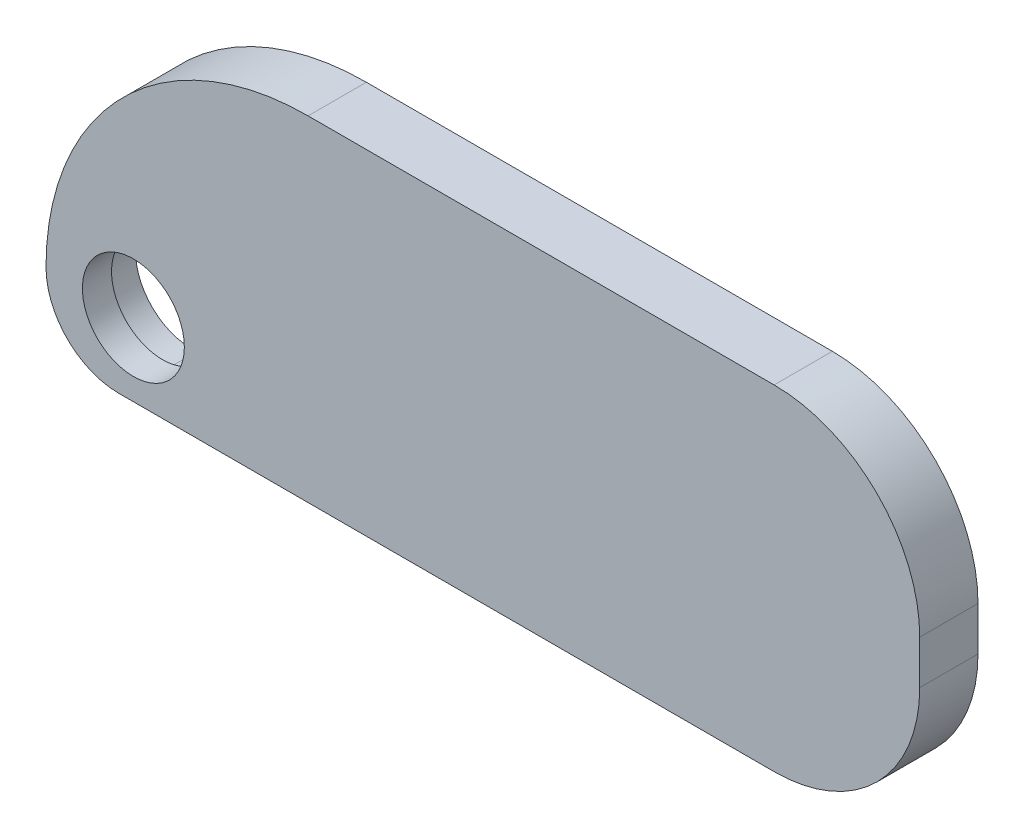
ISO-10303-21;
HEADER;
FILE_DESCRIPTION(('STEP AP214'),'2;1');
FILE_NAME('part.step','',(''),(''),'','','');
FILE_SCHEMA(('AUTOMOTIVE_DESIGN { 1 0 10303 214 1 1 1 1 }'));
ENDSEC;
DATA;
#1=APPLICATION_CONTEXT('core data for automotive mechanical design processes');
#2=APPLICATION_PROTOCOL_DEFINITION('international standard','automotive_design',2000,#1);
#3=PRODUCT_CONTEXT('',#1,'mechanical');
#4=PRODUCT('Part','Part','',(#3));
#5=PRODUCT_RELATED_PRODUCT_CATEGORY('part','',(#4));
#6=PRODUCT_DEFINITION_FORMATION('','',#4);
#7=PRODUCT_DEFINITION_CONTEXT('part definition',#1,'design');
#8=PRODUCT_DEFINITION('design','',#6,#7);
#9=PRODUCT_DEFINITION_SHAPE('','',#8);
#10=(LENGTH_UNIT() NAMED_UNIT(*) SI_UNIT(.MILLI.,.METRE.));
#11=(NAMED_UNIT(*) PLANE_ANGLE_UNIT() SI_UNIT($,.RADIAN.));
#12=(NAMED_UNIT(*) SI_UNIT($,.STERADIAN.) SOLID_ANGLE_UNIT());
#13=UNCERTAINTY_MEASURE_WITH_UNIT(LENGTH_MEASURE(1.E-05),#10,'distance_accuracy_value','');
#14=(GEOMETRIC_REPRESENTATION_CONTEXT(3) GLOBAL_UNCERTAINTY_ASSIGNED_CONTEXT((#13)) GLOBAL_UNIT_ASSIGNED_CONTEXT((#10,
#11,#12)) REPRESENTATION_CONTEXT('',''));
#15=CARTESIAN_POINT('',(0.,0.,0.));
#16=DIRECTION('',(0.,0.,1.));
#17=DIRECTION('',(1.,0.,0.));
#18=AXIS2_PLACEMENT_3D('',#15,#16,#17);
#19=CARTESIAN_POINT('',(0.,18.,-4.));
#20=DIRECTION('',(0.,-1.,0.));
#21=DIRECTION('',(0.,0.,1.));
#22=AXIS2_PLACEMENT_3D('',#19,#20,#21);
#23=PLANE('',#22);
#24=DIRECTION('',(0.,0.,-1.));
#25=VECTOR('',#24,1.);
#26=CARTESIAN_POINT('',(18.,18.,0.));
#27=LINE('',#26,#25);
#28=CARTESIAN_POINT('',(18.,18.,0.));
#29=VERTEX_POINT('',#28);
#30=CARTESIAN_POINT('',(18.,18.,-4.));
#31=VERTEX_POINT('',#30);
#32=EDGE_CURVE('E122',#29,#31,#27,.T.);
#33=ORIENTED_EDGE('',*,*,#32,.F.);
#34=DIRECTION('',(-1.,0.,0.));
#35=VECTOR('',#34,1.);
#36=CARTESIAN_POINT('',(0.,18.,0.));
#37=LINE('',#36,#35);
#38=CARTESIAN_POINT('',(50.,18.,0.));
#39=VERTEX_POINT('',#38);
#40=EDGE_CURVE('E128',#39,#29,#37,.T.);
#41=ORIENTED_EDGE('',*,*,#40,.F.);
#42=DIRECTION('',(0.,0.,1.));
#43=VECTOR('',#42,1.);
#44=CARTESIAN_POINT('',(50.,18.,-4.));
#45=LINE('',#44,#43);
#46=CARTESIAN_POINT('',(50.,18.,-4.));
#47=VERTEX_POINT('',#46);
#48=EDGE_CURVE('E187',#47,#39,#45,.T.);
#49=ORIENTED_EDGE('',*,*,#48,.F.);
#50=DIRECTION('',(-1.,0.,0.));
#51=VECTOR('',#50,1.);
#52=CARTESIAN_POINT('',(0.,18.,-4.));
#53=LINE('',#52,#51);
#54=EDGE_CURVE('E140',#47,#31,#53,.T.);
#55=ORIENTED_EDGE('',*,*,#54,.T.);
#56=EDGE_LOOP('',(#33,#41,#49,#55));
#57=FACE_BOUND('',#56,.T.);
#58=ADVANCED_FACE('F39',(#57),#23,.F.);
#59=CARTESIAN_POINT('',(6.,0.,0.));
#60=DIRECTION('',(0.,0.,-1.));
#61=DIRECTION('',(1.,0.,0.));
#62=AXIS2_PLACEMENT_3D('',#59,#60,#61);
#63=CYLINDRICAL_SURFACE('',#62,3.5);
#64=CARTESIAN_POINT('',(6.,0.,0.));
#65=DIRECTION('',(0.,0.,1.));
#66=DIRECTION('',(1.,0.,0.));
#67=AXIS2_PLACEMENT_3D('',#64,#65,#66);
#68=CIRCLE('',#67,3.5);
#69=CARTESIAN_POINT('',(9.5,0.,0.));
#70=VERTEX_POINT('',#69);
#71=EDGE_CURVE('E177',#70,#70,#68,.T.);
#72=ORIENTED_EDGE('',*,*,#71,.T.);
#73=EDGE_LOOP('',(#72));
#74=FACE_BOUND('',#73,.T.);
#75=CARTESIAN_POINT('',(6.,0.,-2.));
#76=DIRECTION('',(0.,0.,1.));
#77=DIRECTION('',(1.,0.,0.));
#78=AXIS2_PLACEMENT_3D('',#75,#76,#77);
#79=CIRCLE('',#78,3.5);
#80=CARTESIAN_POINT('',(9.5,0.,-2.));
#81=VERTEX_POINT('',#80);
#82=EDGE_CURVE('E171',#81,#81,#79,.F.);
#83=ORIENTED_EDGE('',*,*,#82,.T.);
#84=EDGE_LOOP('',(#83));
#85=FACE_BOUND('',#84,.T.);
#86=ADVANCED_FACE('F242',(#74,#85),#63,.F.);
#87=CARTESIAN_POINT('',(0.,-5.,-4.));
#88=DIRECTION('',(0.,1.,0.));
#89=DIRECTION('',(-1.,0.,0.));
#90=AXIS2_PLACEMENT_3D('',#87,#88,#89);
#91=PLANE('',#90);
#92=DIRECTION('',(1.,0.,0.));
#93=VECTOR('',#92,1.);
#94=CARTESIAN_POINT('',(0.,-5.,-4.));
#95=LINE('',#94,#93);
#96=CARTESIAN_POINT('',(5.,-5.,-4.));
#97=VERTEX_POINT('',#96);
#98=CARTESIAN_POINT('',(50.,-5.,-4.));
#99=VERTEX_POINT('',#98);
#100=EDGE_CURVE('E135',#97,#99,#95,.T.);
#101=ORIENTED_EDGE('',*,*,#100,.T.);
#102=DIRECTION('',(0.,0.,1.));
#103=VECTOR('',#102,1.);
#104=CARTESIAN_POINT('',(50.,-5.,-4.));
#105=LINE('',#104,#103);
#106=CARTESIAN_POINT('',(50.,-5.,0.));
#107=VERTEX_POINT('',#106);
#108=EDGE_CURVE('E205',#107,#99,#105,.F.);
#109=ORIENTED_EDGE('',*,*,#108,.F.);
#110=DIRECTION('',(1.,0.,0.));
#111=VECTOR('',#110,1.);
#112=CARTESIAN_POINT('',(0.,-5.,0.));
#113=LINE('',#112,#111);
#114=CARTESIAN_POINT('',(5.,-5.,0.));
#115=VERTEX_POINT('',#114);
#116=EDGE_CURVE('E180',#115,#107,#113,.T.);
#117=ORIENTED_EDGE('',*,*,#116,.F.);
#118=DIRECTION('',(0.,0.,1.));
#119=VECTOR('',#118,1.);
#120=CARTESIAN_POINT('',(5.,-5.,-4.));
#121=LINE('',#120,#119);
#122=EDGE_CURVE('E208',#97,#115,#121,.T.);
#123=ORIENTED_EDGE('',*,*,#122,.F.);
#124=EDGE_LOOP('',(#101,#109,#117,#123));
#125=FACE_BOUND('',#124,.T.);
#126=ADVANCED_FACE('F220',(#125),#91,.F.);
#127=CARTESIAN_POINT('',(60.,18.,-4.));
#128=DIRECTION('',(-1.,0.,0.));
#129=DIRECTION('',(0.,0.,-1.));
#130=AXIS2_PLACEMENT_3D('',#127,#128,#129);
#131=PLANE('',#130);
#132=DIRECTION('',(0.,1.,0.));
#133=VECTOR('',#132,1.);
#134=CARTESIAN_POINT('',(60.,18.,0.));
#135=LINE('',#134,#133);
#136=CARTESIAN_POINT('',(60.,5.,0.));
#137=VERTEX_POINT('',#136);
#138=CARTESIAN_POINT('',(60.,8.,0.));
#139=VERTEX_POINT('',#138);
#140=EDGE_CURVE('E136',#137,#139,#135,.T.);
#141=ORIENTED_EDGE('',*,*,#140,.F.);
#142=DIRECTION('',(0.,0.,1.));
#143=VECTOR('',#142,1.);
#144=CARTESIAN_POINT('',(60.,5.,-4.));
#145=LINE('',#144,#143);
#146=CARTESIAN_POINT('',(60.,5.,-4.));
#147=VERTEX_POINT('',#146);
#148=EDGE_CURVE('E195',#147,#137,#145,.T.);
#149=ORIENTED_EDGE('',*,*,#148,.F.);
#150=DIRECTION('',(0.,1.,0.));
#151=VECTOR('',#150,1.);
#152=CARTESIAN_POINT('',(60.,18.,-4.));
#153=LINE('',#152,#151);
#154=CARTESIAN_POINT('',(60.,8.,-4.));
#155=VERTEX_POINT('',#154);
#156=EDGE_CURVE('E183',#147,#155,#153,.T.);
#157=ORIENTED_EDGE('',*,*,#156,.T.);
#158=DIRECTION('',(0.,0.,1.));
#159=VECTOR('',#158,1.);
#160=CARTESIAN_POINT('',(60.,8.,-4.));
#161=LINE('',#160,#159);
#162=EDGE_CURVE('E198',#139,#155,#161,.F.);
#163=ORIENTED_EDGE('',*,*,#162,.F.);
#164=EDGE_LOOP('',(#141,#149,#157,#163));
#165=FACE_BOUND('',#164,.T.);
#166=ADVANCED_FACE('F228',(#165),#131,.F.);
#167=CARTESIAN_POINT('',(0.,0.,-4.));
#168=DIRECTION('',(0.,0.,-1.));
#169=DIRECTION('',(1.,0.,0.));
#170=AXIS2_PLACEMENT_3D('',#167,#168,#169);
#171=PLANE('',#170);
#172=CARTESIAN_POINT('',(18.,0.,-4.));
#173=DIRECTION('',(0.,0.,-1.));
#174=DIRECTION('',(1.,0.,0.));
#175=AXIS2_PLACEMENT_3D('',#172,#173,#174);
#176=CIRCLE('',#175,18.);
#177=CARTESIAN_POINT('',(0.,0.,-4.));
#178=VERTEX_POINT('',#177);
#179=EDGE_CURVE('E125',#178,#31,#176,.T.);
#180=ORIENTED_EDGE('',*,*,#179,.T.);
#181=ORIENTED_EDGE('',*,*,#54,.F.);
#182=CARTESIAN_POINT('',(50.,8.,-4.));
#183=DIRECTION('',(0.,0.,1.));
#184=DIRECTION('',(1.,0.,0.));
#185=AXIS2_PLACEMENT_3D('',#182,#183,#184);
#186=CIRCLE('',#185,10.);
#187=EDGE_CURVE('E203',#155,#47,#186,.T.);
#188=ORIENTED_EDGE('',*,*,#187,.F.);
#189=ORIENTED_EDGE('',*,*,#156,.F.);
#190=CARTESIAN_POINT('',(50.,5.,-4.));
#191=DIRECTION('',(0.,0.,1.));
#192=DIRECTION('',(1.,0.,0.));
#193=AXIS2_PLACEMENT_3D('',#190,#191,#192);
#194=CIRCLE('',#193,10.);
#195=EDGE_CURVE('E201',#99,#147,#194,.T.);
#196=ORIENTED_EDGE('',*,*,#195,.F.);
#197=ORIENTED_EDGE('',*,*,#100,.F.);
#198=CARTESIAN_POINT('',(5.,0.,-4.));
#199=DIRECTION('',(0.,0.,1.));
#200=DIRECTION('',(1.,0.,0.));
#201=AXIS2_PLACEMENT_3D('',#198,#199,#200);
#202=CIRCLE('',#201,5.);
#203=EDGE_CURVE('E11',#178,#97,#202,.T.);
#204=ORIENTED_EDGE('',*,*,#203,.F.);
#205=EDGE_LOOP('',(#180,#181,#188,#189,#196,#197,#204));
#206=FACE_BOUND('',#205,.T.);
#207=CARTESIAN_POINT('',(6.00000000000035,-6.16694195709755E-13,-4.));
#208=DIRECTION('',(0.,0.,1.));
#209=DIRECTION('',(1.,0.,0.));
#210=AXIS2_PLACEMENT_3D('',#207,#208,#209);
#211=CIRCLE('',#210,3.85000000000071);
#212=CARTESIAN_POINT('',(6.28156000805812,3.83969060757026,-4.));
#213=VERTEX_POINT('',#212);
#214=CARTESIAN_POINT('',(6.37012071171951,-3.83216787977337,-4.));
#215=VERTEX_POINT('',#214);
#216=EDGE_CURVE('E141',#213,#215,#211,.T.);
#217=ORIENTED_EDGE('',*,*,#216,.T.);
#218=DIRECTION('',(0.995368280460271,0.0961352497971664,0.));
#219=VECTOR('',#218,1.);
#220=CARTESIAN_POINT('',(22.1892755283354,-2.30431288406043,-4.));
#221=LINE('',#220,#219);
#222=CARTESIAN_POINT('',(22.1892755283354,-2.30431288406041,-4.));
#223=VERTEX_POINT('',#222);
#224=EDGE_CURVE('E144',#215,#223,#221,.T.);
#225=ORIENTED_EDGE('',*,*,#224,.T.);
#226=CARTESIAN_POINT('',(21.9489374038425,0.184107817090359,-4.));
#227=DIRECTION('',(0.,0.,1.));
#228=DIRECTION('',(-1.,0.,0.));
#229=AXIS2_PLACEMENT_3D('',#226,#227,#228);
#230=CIRCLE('',#229,2.50000000000009);
#231=CARTESIAN_POINT('',(22.1317685779058,2.67741340642172,-4.));
#232=VERTEX_POINT('',#231);
#233=EDGE_CURVE('E164',#223,#232,#230,.T.);
#234=ORIENTED_EDGE('',*,*,#233,.T.);
#235=DIRECTION('',(-0.99732223573251,0.0731324696253838,0.));
#236=VECTOR('',#235,1.);
#237=CARTESIAN_POINT('',(6.28156000805812,3.83969060757026,-4.));
#238=LINE('',#237,#236);
#239=EDGE_CURVE('E152',#232,#213,#238,.T.);
#240=ORIENTED_EDGE('',*,*,#239,.T.);
#241=EDGE_LOOP('',(#217,#225,#234,#240));
#242=FACE_BOUND('',#241,.T.);
#243=ADVANCED_FACE('F215',(#206,#242),#171,.T.);
#244=CARTESIAN_POINT('',(0.,0.,0.));
#245=DIRECTION('',(0.,0.,-1.));
#246=DIRECTION('',(1.,0.,0.));
#247=AXIS2_PLACEMENT_3D('',#244,#245,#246);
#248=PLANE('',#247);
#249=ORIENTED_EDGE('',*,*,#71,.F.);
#250=EDGE_LOOP('',(#249));
#251=FACE_BOUND('',#250,.T.);
#252=CARTESIAN_POINT('',(5.,0.,0.));
#253=DIRECTION('',(0.,0.,1.));
#254=DIRECTION('',(1.,0.,0.));
#255=AXIS2_PLACEMENT_3D('',#252,#253,#254);
#256=CIRCLE('',#255,5.);
#257=CARTESIAN_POINT('',(0.,0.,0.));
#258=VERTEX_POINT('',#257);
#259=EDGE_CURVE('E212',#115,#258,#256,.F.);
#260=ORIENTED_EDGE('',*,*,#259,.F.);
#261=ORIENTED_EDGE('',*,*,#116,.T.);
#262=CARTESIAN_POINT('',(50.,5.,0.));
#263=DIRECTION('',(0.,0.,1.));
#264=DIRECTION('',(1.,0.,0.));
#265=AXIS2_PLACEMENT_3D('',#262,#263,#264);
#266=CIRCLE('',#265,10.);
#267=EDGE_CURVE('E192',#137,#107,#266,.F.);
#268=ORIENTED_EDGE('',*,*,#267,.F.);
#269=ORIENTED_EDGE('',*,*,#140,.T.);
#270=CARTESIAN_POINT('',(50.,8.,0.));
#271=DIRECTION('',(0.,0.,1.));
#272=DIRECTION('',(1.,0.,0.));
#273=AXIS2_PLACEMENT_3D('',#270,#271,#272);
#274=CIRCLE('',#273,10.);
#275=EDGE_CURVE('E131',#39,#139,#274,.F.);
#276=ORIENTED_EDGE('',*,*,#275,.F.);
#277=ORIENTED_EDGE('',*,*,#40,.T.);
#278=CARTESIAN_POINT('',(18.,0.,0.));
#279=DIRECTION('',(0.,0.,-1.));
#280=DIRECTION('',(1.,0.,0.));
#281=AXIS2_PLACEMENT_3D('',#278,#279,#280);
#282=CIRCLE('',#281,18.);
#283=EDGE_CURVE('E118',#258,#29,#282,.T.);
#284=ORIENTED_EDGE('',*,*,#283,.F.);
#285=EDGE_LOOP('',(#260,#261,#268,#269,#276,#277,#284));
#286=FACE_BOUND('',#285,.T.);
#287=ADVANCED_FACE('F129',(#251,#286),#248,.F.);
#288=CARTESIAN_POINT('',(50.,8.,-4.));
#289=DIRECTION('',(0.,0.,1.));
#290=DIRECTION('',(-1.,0.,0.));
#291=AXIS2_PLACEMENT_3D('',#288,#289,#290);
#292=CYLINDRICAL_SURFACE('',#291,10.);
#293=ORIENTED_EDGE('',*,*,#187,.T.);
#294=ORIENTED_EDGE('',*,*,#48,.T.);
#295=ORIENTED_EDGE('',*,*,#275,.T.);
#296=ORIENTED_EDGE('',*,*,#162,.T.);
#297=EDGE_LOOP('',(#293,#294,#295,#296));
#298=FACE_BOUND('',#297,.T.);
#299=ADVANCED_FACE('F230',(#298),#292,.T.);
#300=CARTESIAN_POINT('',(50.,5.,-4.));
#301=DIRECTION('',(0.,0.,1.));
#302=DIRECTION('',(-1.,0.,0.));
#303=AXIS2_PLACEMENT_3D('',#300,#301,#302);
#304=CYLINDRICAL_SURFACE('',#303,10.);
#305=ORIENTED_EDGE('',*,*,#195,.T.);
#306=ORIENTED_EDGE('',*,*,#148,.T.);
#307=ORIENTED_EDGE('',*,*,#267,.T.);
#308=ORIENTED_EDGE('',*,*,#108,.T.);
#309=EDGE_LOOP('',(#305,#306,#307,#308));
#310=FACE_BOUND('',#309,.T.);
#311=ADVANCED_FACE('F225',(#310),#304,.T.);
#312=CARTESIAN_POINT('',(6.00000000000035,-6.16694195709755E-13,-2.));
#313=DIRECTION('',(0.,0.,-1.));
#314=DIRECTION('',(1.,0.,0.));
#315=AXIS2_PLACEMENT_3D('',#312,#313,#314);
#316=PLANE('',#315);
#317=CARTESIAN_POINT('',(6.00000000000035,-6.16694195709755E-13,-2.));
#318=DIRECTION('',(0.,0.,1.));
#319=DIRECTION('',(1.,0.,0.));
#320=AXIS2_PLACEMENT_3D('',#317,#318,#319);
#321=CIRCLE('',#320,3.85000000000071);
#322=CARTESIAN_POINT('',(6.28156000805812,3.83969060757026,-2.));
#323=VERTEX_POINT('',#322);
#324=CARTESIAN_POINT('',(6.37012071171951,-3.83216787977337,-2.));
#325=VERTEX_POINT('',#324);
#326=EDGE_CURVE('E148',#323,#325,#321,.T.);
#327=ORIENTED_EDGE('',*,*,#326,.F.);
#328=DIRECTION('',(-0.99732223573251,0.0731324696253838,0.));
#329=VECTOR('',#328,1.);
#330=CARTESIAN_POINT('',(6.28156000805812,3.83969060757026,-2.));
#331=LINE('',#330,#329);
#332=CARTESIAN_POINT('',(22.1317685779058,2.67741340642172,-2.));
#333=VERTEX_POINT('',#332);
#334=EDGE_CURVE('E158',#333,#323,#331,.T.);
#335=ORIENTED_EDGE('',*,*,#334,.F.);
#336=CARTESIAN_POINT('',(21.9489374038425,0.184107817090359,-2.));
#337=DIRECTION('',(0.,0.,1.));
#338=DIRECTION('',(-1.,0.,0.));
#339=AXIS2_PLACEMENT_3D('',#336,#337,#338);
#340=CIRCLE('',#339,2.50000000000009);
#341=CARTESIAN_POINT('',(22.1892755283354,-2.30431288406041,-2.));
#342=VERTEX_POINT('',#341);
#343=EDGE_CURVE('E155',#342,#333,#340,.T.);
#344=ORIENTED_EDGE('',*,*,#343,.F.);
#345=DIRECTION('',(0.995368280460271,0.0961352497971664,0.));
#346=VECTOR('',#345,1.);
#347=CARTESIAN_POINT('',(22.1892755283354,-2.30431288406043,-2.));
#348=LINE('',#347,#346);
#349=EDGE_CURVE('E151',#325,#342,#348,.T.);
#350=ORIENTED_EDGE('',*,*,#349,.F.);
#351=EDGE_LOOP('',(#327,#335,#344,#350));
#352=FACE_BOUND('',#351,.T.);
#353=ORIENTED_EDGE('',*,*,#82,.F.);
#354=EDGE_LOOP('',(#353));
#355=FACE_BOUND('',#354,.T.);
#356=ADVANCED_FACE('F237',(#352,#355),#316,.T.);
#357=CARTESIAN_POINT('',(6.00000000000035,-6.16694195709755E-13,-2.));
#358=DIRECTION('',(0.,0.,-1.));
#359=DIRECTION('',(1.,0.,0.));
#360=AXIS2_PLACEMENT_3D('',#357,#358,#359);
#361=CYLINDRICAL_SURFACE('',#360,3.85000000000071);
#362=ORIENTED_EDGE('',*,*,#216,.F.);
#363=DIRECTION('',(0.,0.,-1.));
#364=VECTOR('',#363,1.);
#365=CARTESIAN_POINT('',(6.28156000805812,3.83969060757026,-2.));
#366=LINE('',#365,#364);
#367=EDGE_CURVE('E169',#323,#213,#366,.T.);
#368=ORIENTED_EDGE('',*,*,#367,.F.);
#369=ORIENTED_EDGE('',*,*,#326,.T.);
#370=DIRECTION('',(0.,0.,-1.));
#371=VECTOR('',#370,1.);
#372=CARTESIAN_POINT('',(6.37012071171951,-3.83216787977337,-2.));
#373=LINE('',#372,#371);
#374=EDGE_CURVE('E160',#325,#215,#373,.T.);
#375=ORIENTED_EDGE('',*,*,#374,.T.);
#376=EDGE_LOOP('',(#362,#368,#369,#375));
#377=FACE_BOUND('',#376,.T.);
#378=ADVANCED_FACE('F292',(#377),#361,.F.);
#379=CARTESIAN_POINT('',(6.28156000805812,3.83969060757026,-2.));
#380=DIRECTION('',(0.0731324696253838,0.99732223573251,0.));
#381=DIRECTION('',(-0.99732223573251,0.0731324696253839,0.));
#382=AXIS2_PLACEMENT_3D('',#379,#380,#381);
#383=PLANE('',#382);
#384=ORIENTED_EDGE('',*,*,#239,.F.);
#385=DIRECTION('',(0.,0.,-1.));
#386=VECTOR('',#385,1.);
#387=CARTESIAN_POINT('',(22.1317685779058,2.67741340642172,-2.));
#388=LINE('',#387,#386);
#389=EDGE_CURVE('E172',#333,#232,#388,.T.);
#390=ORIENTED_EDGE('',*,*,#389,.F.);
#391=ORIENTED_EDGE('',*,*,#334,.T.);
#392=ORIENTED_EDGE('',*,*,#367,.T.);
#393=EDGE_LOOP('',(#384,#390,#391,#392));
#394=FACE_BOUND('',#393,.T.);
#395=ADVANCED_FACE('F303',(#394),#383,.F.);
#396=CARTESIAN_POINT('',(21.9489374038425,0.184107817090359,-2.));
#397=DIRECTION('',(0.,0.,-1.));
#398=DIRECTION('',(1.,0.,0.));
#399=AXIS2_PLACEMENT_3D('',#396,#397,#398);
#400=CYLINDRICAL_SURFACE('',#399,2.50000000000009);
#401=ORIENTED_EDGE('',*,*,#233,.F.);
#402=DIRECTION('',(0.,0.,-1.));
#403=VECTOR('',#402,1.);
#404=CARTESIAN_POINT('',(22.1892755283354,-2.30431288406041,-2.));
#405=LINE('',#404,#403);
#406=EDGE_CURVE('E174',#342,#223,#405,.T.);
#407=ORIENTED_EDGE('',*,*,#406,.F.);
#408=ORIENTED_EDGE('',*,*,#343,.T.);
#409=ORIENTED_EDGE('',*,*,#389,.T.);
#410=EDGE_LOOP('',(#401,#407,#408,#409));
#411=FACE_BOUND('',#410,.T.);
#412=ADVANCED_FACE('F314',(#411),#400,.F.);
#413=CARTESIAN_POINT('',(22.1892755283354,-2.30431288406043,-2.));
#414=DIRECTION('',(0.0961352497971664,-0.995368280460271,0.));
#415=DIRECTION('',(0.995368280460271,0.0961352497971664,0.));
#416=AXIS2_PLACEMENT_3D('',#413,#414,#415);
#417=PLANE('',#416);
#418=ORIENTED_EDGE('',*,*,#224,.F.);
#419=ORIENTED_EDGE('',*,*,#374,.F.);
#420=ORIENTED_EDGE('',*,*,#349,.T.);
#421=ORIENTED_EDGE('',*,*,#406,.T.);
#422=EDGE_LOOP('',(#418,#419,#420,#421));
#423=FACE_BOUND('',#422,.T.);
#424=ADVANCED_FACE('F325',(#423),#417,.F.);
#425=CARTESIAN_POINT('',(5.,0.,-4.));
#426=DIRECTION('',(0.,0.,1.));
#427=DIRECTION('',(-1.,0.,0.));
#428=AXIS2_PLACEMENT_3D('',#425,#426,#427);
#429=CYLINDRICAL_SURFACE('',#428,5.);
#430=ORIENTED_EDGE('',*,*,#203,.T.);
#431=ORIENTED_EDGE('',*,*,#122,.T.);
#432=ORIENTED_EDGE('',*,*,#259,.T.);
#433=DIRECTION('',(0.,0.,1.));
#434=VECTOR('',#433,1.);
#435=CARTESIAN_POINT('',(0.,0.,-4.));
#436=LINE('',#435,#434);
#437=EDGE_CURVE('E47',#258,#178,#436,.F.);
#438=ORIENTED_EDGE('',*,*,#437,.T.);
#439=EDGE_LOOP('',(#430,#431,#432,#438));
#440=FACE_BOUND('',#439,.T.);
#441=ADVANCED_FACE('F41',(#440),#429,.T.);
#442=CARTESIAN_POINT('',(18.,0.,0.));
#443=DIRECTION('',(0.,0.,-1.));
#444=DIRECTION('',(1.,0.,0.));
#445=AXIS2_PLACEMENT_3D('',#442,#443,#444);
#446=CYLINDRICAL_SURFACE('',#445,18.);
#447=ORIENTED_EDGE('',*,*,#179,.F.);
#448=ORIENTED_EDGE('',*,*,#437,.F.);
#449=ORIENTED_EDGE('',*,*,#283,.T.);
#450=ORIENTED_EDGE('',*,*,#32,.T.);
#451=EDGE_LOOP('',(#447,#448,#449,#450));
#452=FACE_BOUND('',#451,.T.);
#453=ADVANCED_FACE('F120',(#452),#446,.T.);
#454=CLOSED_SHELL('',(#58,#86,#126,#166,#243,#287,#299,#311,#356,#378,#395,#412,#424,#441,#453));
#455=MANIFOLD_SOLID_BREP('B2',#454);
#456=ADVANCED_BREP_SHAPE_REPRESENTATION('',(#18,#455),#14);
#457=SHAPE_DEFINITION_REPRESENTATION(#9,#456);
ENDSEC;
END-ISO-10303-21;
